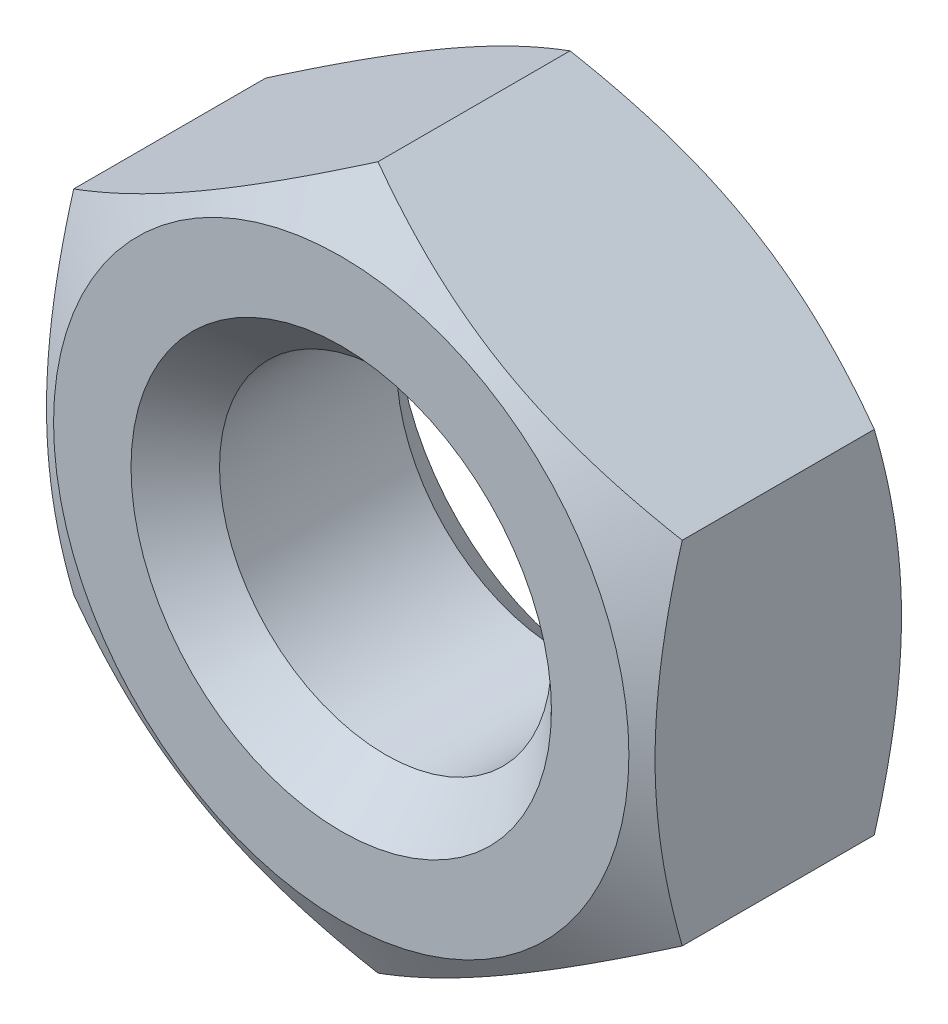
ISO-10303-21;
HEADER;
FILE_DESCRIPTION(('STEP AP214'),'2;1');
FILE_NAME('part.step','',(''),(''),'','','');
FILE_SCHEMA(('AUTOMOTIVE_DESIGN { 1 0 10303 214 1 1 1 1 }'));
ENDSEC;
DATA;
#1=APPLICATION_CONTEXT('core data for automotive mechanical design processes');
#2=APPLICATION_PROTOCOL_DEFINITION('international standard','automotive_design',2000,#1);
#3=PRODUCT_CONTEXT('',#1,'mechanical');
#4=PRODUCT('Part','Part','',(#3));
#5=PRODUCT_RELATED_PRODUCT_CATEGORY('part','',(#4));
#6=PRODUCT_DEFINITION_FORMATION('','',#4);
#7=PRODUCT_DEFINITION_CONTEXT('part definition',#1,'design');
#8=PRODUCT_DEFINITION('design','',#6,#7);
#9=PRODUCT_DEFINITION_SHAPE('','',#8);
#10=(LENGTH_UNIT() NAMED_UNIT(*) SI_UNIT(.MILLI.,.METRE.));
#11=(NAMED_UNIT(*) PLANE_ANGLE_UNIT() SI_UNIT($,.RADIAN.));
#12=(NAMED_UNIT(*) SI_UNIT($,.STERADIAN.) SOLID_ANGLE_UNIT());
#13=UNCERTAINTY_MEASURE_WITH_UNIT(LENGTH_MEASURE(1.E-05),#10,'distance_accuracy_value','');
#14=(GEOMETRIC_REPRESENTATION_CONTEXT(3) GLOBAL_UNCERTAINTY_ASSIGNED_CONTEXT((#13)) GLOBAL_UNIT_ASSIGNED_CONTEXT((#10,
#11,#12)) REPRESENTATION_CONTEXT('',''));
#15=CARTESIAN_POINT('',(0.,0.,0.));
#16=DIRECTION('',(0.,0.,1.));
#17=DIRECTION('',(1.,0.,0.));
#18=AXIS2_PLACEMENT_3D('',#15,#16,#17);
#19=CARTESIAN_POINT('',(0.,0.,0.));
#20=DIRECTION('',(0.,0.,-1.));
#21=DIRECTION('',(-1.,0.,0.));
#22=AXIS2_PLACEMENT_3D('',#19,#20,#21);
#23=PLANE('',#22);
#24=CARTESIAN_POINT('',(0.,0.,0.));
#25=DIRECTION('',(0.,0.,-1.));
#26=DIRECTION('',(-1.,0.,0.));
#27=AXIS2_PLACEMENT_3D('',#24,#25,#26);
#28=CIRCLE('',#27,1.9);
#29=CARTESIAN_POINT('',(-1.9,0.,0.));
#30=VERTEX_POINT('',#29);
#31=EDGE_CURVE('E123',#30,#30,#28,.T.);
#32=ORIENTED_EDGE('',*,*,#31,.T.);
#33=EDGE_LOOP('',(#32));
#34=FACE_BOUND('',#33,.T.);
#35=CARTESIAN_POINT('',(0.,0.,0.));
#36=DIRECTION('',(0.,0.,1.));
#37=DIRECTION('',(1.,0.,0.));
#38=AXIS2_PLACEMENT_3D('',#35,#36,#37);
#39=CIRCLE('',#38,2.6);
#40=CARTESIAN_POINT('',(2.6,0.,0.));
#41=VERTEX_POINT('',#40);
#42=EDGE_CURVE('E244',#41,#41,#39,.T.);
#43=ORIENTED_EDGE('',*,*,#42,.T.);
#44=EDGE_LOOP('',(#43));
#45=FACE_BOUND('',#44,.T.);
#46=ADVANCED_FACE('F36',(#34,#45),#23,.F.);
#47=CARTESIAN_POINT('',(0.,0.,-2.4));
#48=DIRECTION('',(0.,0.,1.));
#49=DIRECTION('',(1.,0.,0.));
#50=AXIS2_PLACEMENT_3D('',#47,#48,#49);
#51=PLANE('',#50);
#52=CARTESIAN_POINT('',(0.,0.,-2.4));
#53=DIRECTION('',(0.,0.,1.));
#54=DIRECTION('',(1.,0.,0.));
#55=AXIS2_PLACEMENT_3D('',#52,#53,#54);
#56=CIRCLE('',#55,1.9);
#57=CARTESIAN_POINT('',(1.9,0.,-2.4));
#58=VERTEX_POINT('',#57);
#59=EDGE_CURVE('E12',#58,#58,#56,.T.);
#60=ORIENTED_EDGE('',*,*,#59,.T.);
#61=EDGE_LOOP('',(#60));
#62=FACE_BOUND('',#61,.T.);
#63=CARTESIAN_POINT('',(0.,0.,-2.4));
#64=DIRECTION('',(0.,0.,1.));
#65=DIRECTION('',(1.,0.,0.));
#66=AXIS2_PLACEMENT_3D('',#63,#64,#65);
#67=CIRCLE('',#66,2.6);
#68=CARTESIAN_POINT('',(2.6,0.,-2.4));
#69=VERTEX_POINT('',#68);
#70=EDGE_CURVE('E243',#69,#69,#67,.T.);
#71=ORIENTED_EDGE('',*,*,#70,.F.);
#72=EDGE_LOOP('',(#71));
#73=FACE_BOUND('',#72,.T.);
#74=ADVANCED_FACE('F209',(#62,#73),#51,.F.);
#75=CARTESIAN_POINT('',(0.,0.,-2.4));
#76=DIRECTION('',(0.,0.,1.));
#77=DIRECTION('',(1.,0.,0.));
#78=AXIS2_PLACEMENT_3D('',#75,#76,#77);
#79=CYLINDRICAL_SURFACE('',#78,1.5);
#80=CARTESIAN_POINT('',(0.,0.,-0.400000000000002));
#81=DIRECTION('',(0.,0.,-1.));
#82=DIRECTION('',(-1.,0.,0.));
#83=AXIS2_PLACEMENT_3D('',#80,#81,#82);
#84=CIRCLE('',#83,1.5);
#85=CARTESIAN_POINT('',(-1.5,0.,-0.400000000000002));
#86=VERTEX_POINT('',#85);
#87=EDGE_CURVE('E44',#86,#86,#84,.F.);
#88=ORIENTED_EDGE('',*,*,#87,.T.);
#89=EDGE_LOOP('',(#88));
#90=FACE_BOUND('',#89,.T.);
#91=CARTESIAN_POINT('',(0.,0.,-2.));
#92=DIRECTION('',(0.,0.,1.));
#93=DIRECTION('',(1.,0.,0.));
#94=AXIS2_PLACEMENT_3D('',#91,#92,#93);
#95=CIRCLE('',#94,1.5);
#96=CARTESIAN_POINT('',(1.5,0.,-2.));
#97=VERTEX_POINT('',#96);
#98=EDGE_CURVE('E235',#97,#97,#95,.F.);
#99=ORIENTED_EDGE('',*,*,#98,.T.);
#100=EDGE_LOOP('',(#99));
#101=FACE_BOUND('',#100,.T.);
#102=ADVANCED_FACE('F206',(#90,#101),#79,.F.);
#103=CARTESIAN_POINT('',(0.,0.,-2.06777736655969));
#104=DIRECTION('',(0.,0.,1.));
#105=DIRECTION('',(1.,0.,0.));
#106=AXIS2_PLACEMENT_3D('',#103,#104,#105);
#107=CONICAL_SURFACE('',#106,3.17542648054294,1.0471975511966);
#108=ORIENTED_EDGE('',*,*,#70,.T.);
#109=EDGE_LOOP('',(#108));
#110=FACE_BOUND('',#109,.T.);
#111=CARTESIAN_POINT('',(-0.000200000000000284,-3.17554195059678,-2.06771069625679));
#112=CARTESIAN_POINT('',(0.120649220659906,-3.10576962051743,-2.10800979737229));
#113=CARTESIAN_POINT('',(0.242541602622634,-3.03539502097908,-2.14466055702389));
#114=CARTESIAN_POINT('',(0.488437126727893,-2.89342717394439,-2.20863527665175));
#115=CARTESIAN_POINT('',(0.612444638573856,-2.82183140359858,-2.23593660394706));
#116=CARTESIAN_POINT('',(0.858922797975945,-2.67952717191842,-2.27843571432744));
#117=CARTESIAN_POINT('',(0.981355518587418,-2.60884060771577,-2.2939163409991));
#118=CARTESIAN_POINT('',(1.22679714236892,-2.46713482015519,-2.31239806225161));
#119=CARTESIAN_POINT('',(1.34980515323291,-2.39611611197038,-2.31541446015895));
#120=CARTESIAN_POINT('',(1.57965878661079,-2.26341005486544,-2.30914431419301));
#121=CARTESIAN_POINT('',(1.68653879125402,-2.20170285541369,-2.30139730534485));
#122=CARTESIAN_POINT('',(1.89960246733475,-2.07869048467395,-2.2768422785572));
#123=CARTESIAN_POINT('',(2.00578540164889,-2.01738573896433,-2.26002586997098));
#124=CARTESIAN_POINT('',(2.21928848939318,-1.89411967378235,-2.2179855372756));
#125=CARTESIAN_POINT('',(2.32658161614286,-1.83217395817123,-2.19258337893432));
#126=CARTESIAN_POINT('',(2.53956747928405,-1.70920651275308,-2.13493023378157));
#127=CARTESIAN_POINT('',(2.64526294502665,-1.64818320715446,-2.10269279632257));
#128=CARTESIAN_POINT('',(2.7502,-1.58759777021763,-2.06771069625679));
#129=B_SPLINE_CURVE_WITH_KNOTS('',3,(#111,#112,#113,#114,#115,#116,#117,#118,#119,#120,#121,
#122,#123,#124,#125,#126,#127,#128),.UNSPECIFIED.,.F.,.F.,(4,2,2,2,2,2,2,2,4),(0.,
0.435912828725889,0.872873557116334,1.29901931904672,1.72464171213574,2.09526089052938,
2.46622354066374,2.84541551798557,3.22386274754524),.UNSPECIFIED.);
#130=CARTESIAN_POINT('',(0.,-3.17542648054294,-2.06777736655969));
#131=VERTEX_POINT('',#130);
#132=CARTESIAN_POINT('',(2.75,-1.58771324027147,-2.06777736655969));
#133=VERTEX_POINT('',#132);
#134=EDGE_CURVE('E247',#131,#133,#129,.T.);
#135=ORIENTED_EDGE('',*,*,#134,.F.);
#136=CARTESIAN_POINT('',(-2.7502,-1.58759777021763,-2.06771069625679));
#137=CARTESIAN_POINT('',(-2.62935077934009,-1.65737010029699,-2.10800979737229));
#138=CARTESIAN_POINT('',(-2.50745839737737,-1.72774469983533,-2.14466055702389));
#139=CARTESIAN_POINT('',(-2.26156287327211,-1.86971254687003,-2.20863527665175));
#140=CARTESIAN_POINT('',(-2.13755536142614,-1.94130831721583,-2.23593660394706));
#141=CARTESIAN_POINT('',(-1.89107720202406,-2.08361254889599,-2.27843571432744));
#142=CARTESIAN_POINT('',(-1.76864448141258,-2.15429911309864,-2.2939163409991));
#143=CARTESIAN_POINT('',(-1.52320285763108,-2.29600490065923,-2.31239806225161));
#144=CARTESIAN_POINT('',(-1.40019484676709,-2.36702360884404,-2.31541446015896));
#145=CARTESIAN_POINT('',(-1.17034121338921,-2.49972966594897,-2.30914431419301));
#146=CARTESIAN_POINT('',(-1.06346120874598,-2.56143686540073,-2.30139730534485));
#147=CARTESIAN_POINT('',(-0.850397532665249,-2.68444923614047,-2.2768422785572));
#148=CARTESIAN_POINT('',(-0.74421459835111,-2.74575398185008,-2.26002586997098));
#149=CARTESIAN_POINT('',(-0.530711510606816,-2.86902004703207,-2.2179855372756));
#150=CARTESIAN_POINT('',(-0.423418383857144,-2.93096576264318,-2.19258337893432));
#151=CARTESIAN_POINT('',(-0.210432520715948,-3.05393320806134,-2.13493023378157));
#152=CARTESIAN_POINT('',(-0.104737054973347,-3.11495651365995,-2.10269279632257));
#153=CARTESIAN_POINT('',(0.000199999999999426,-3.17554195059678,-2.06771069625679));
#154=B_SPLINE_CURVE_WITH_KNOTS('',3,(#136,#137,#138,#139,#140,#141,#142,#143,#144,#145,#146,
#147,#148,#149,#150,#151,#152,#153),.UNSPECIFIED.,.F.,.F.,(4,2,2,2,2,2,2,2,4),(0.,
0.435912828725889,0.872873557116333,1.29901931904672,1.72464171213574,2.09526089052938,
2.46622354066375,2.84541551798557,3.22386274754524),.UNSPECIFIED.);
#155=CARTESIAN_POINT('',(-2.75,-1.58771324027147,-2.06777736655969));
#156=VERTEX_POINT('',#155);
#157=EDGE_CURVE('E192',#156,#131,#154,.T.);
#158=ORIENTED_EDGE('',*,*,#157,.F.);
#159=CARTESIAN_POINT('',(-2.75,-4.19884947767623,-1.00324729523422));
#160=CARTESIAN_POINT('',(-2.75,-4.07820187124267,-1.0615009399061));
#161=CARTESIAN_POINT('',(-2.75,-3.95726765142687,-1.1191718051079));
#162=CARTESIAN_POINT('',(-2.75,-3.71467095127294,-1.23301467455796));
#163=CARTESIAN_POINT('',(-2.75,-3.59300834795839,-1.28918641643437));
#164=CARTESIAN_POINT('',(-2.75,-3.34813668893729,-1.39999627791941));
#165=CARTESIAN_POINT('',(-2.75,-3.22492276000227,-1.45462366765477));
#166=CARTESIAN_POINT('',(-2.75,-2.97747774547981,-1.56151471187697));
#167=CARTESIAN_POINT('',(-2.75,-2.85324671376196,-1.61377849060522));
#168=CARTESIAN_POINT('',(-2.75,-2.60208370369777,-1.71591086029007));
#169=CARTESIAN_POINT('',(-2.75,-2.47513715768685,-1.76574382426539));
#170=CARTESIAN_POINT('',(-2.75,-2.21974245679256,-1.86147679334899));
#171=CARTESIAN_POINT('',(-2.75,-2.09129413609857,-1.90737635942135));
#172=CARTESIAN_POINT('',(-2.75,-1.83295938473879,-1.99400044635392));
#173=CARTESIAN_POINT('',(-2.75,-1.70307671728886,-2.03473607471567));
#174=CARTESIAN_POINT('',(-2.75,-1.44146555885123,-2.10970156439133));
#175=CARTESIAN_POINT('',(-2.75,-1.30973766944262,-2.14393349536887));
#176=CARTESIAN_POINT('',(-2.75,-1.04434124503234,-2.20422326752026));
#177=CARTESIAN_POINT('',(-2.75,-0.910672058310025,-2.23027829396732));
#178=CARTESIAN_POINT('',(-2.75,-0.641735620473645,-2.27244973081023));
#179=CARTESIAN_POINT('',(-2.75,-0.506468365718288,-2.28856611855589));
#180=CARTESIAN_POINT('',(-2.75,-0.23589149454194,-2.3094342529984));
#181=CARTESIAN_POINT('',(-2.75,-0.100587471778889,-2.31425668852583));
#182=CARTESIAN_POINT('',(-2.75,0.169905978990568,-2.31228604098852));
#183=CARTESIAN_POINT('',(-2.75,0.305095427389367,-2.30549591165469));
#184=CARTESIAN_POINT('',(-2.75,0.536330663357067,-2.28442535724379));
#185=CARTESIAN_POINT('',(-2.75,0.632632338062295,-2.27280685654652));
#186=CARTESIAN_POINT('',(-2.75,0.824483683551794,-2.24443929714952));
#187=CARTESIAN_POINT('',(-2.75,0.920033231736865,-2.22768941908104));
#188=CARTESIAN_POINT('',(-2.75,1.20548016226049,-2.17062279013484));
#189=CARTESIAN_POINT('',(-2.75,1.39403020083751,-2.12350401114232));
#190=CARTESIAN_POINT('',(-2.75,1.67614316578904,-2.04233927716781));
#191=CARTESIAN_POINT('',(-2.75,1.77117911516138,-2.0131269363236));
#192=CARTESIAN_POINT('',(-2.75,1.96025880041966,-1.95183724381465));
#193=CARTESIAN_POINT('',(-2.75,2.05430317417982,-1.91976187783346));
#194=CARTESIAN_POINT('',(-2.75,2.2410062869198,-1.85341152507458));
#195=CARTESIAN_POINT('',(-2.75,2.33366985134413,-1.81914998009173));
#196=CARTESIAN_POINT('',(-2.75,2.51828022728366,-1.74863247237806));
#197=CARTESIAN_POINT('',(-2.75,2.61022672765318,-1.71237569347922));
#198=CARTESIAN_POINT('',(-2.75,2.70184189574077,-1.67531873375452));
#199=B_SPLINE_CURVE_WITH_KNOTS('',3,(#159,#160,#161,#162,#163,#164,#165,#166,#167,#168,#169,
#170,#171,#172,#173,#174,#175,#176,#177,#178,#179,#180,#181,#182,#183,#184,#185,#186,#187,#188,
#189,#190,#191,#192,#193,#194,#195,#196,#197,#198),.UNSPECIFIED.,.F.,.F.,(4,2,2,2,2,2,2,2,2,2,2,
2,2,2,2,2,2,2,2,4),(0.,0.401930814051669,0.803931517493362,1.2082537458897,1.61255469663453,
2.02163603949035,2.43076298365977,2.83899440936265,3.24709570567847,3.65533732855418,
4.06357988181069,4.46926033631124,4.87483761871264,5.1656953663785,5.45659958189496,
6.03884523217754,6.33709483857768,6.6351391744495,6.93150072183923,7.22798441293264),.UNSPECIFIED.);
#200=CARTESIAN_POINT('',(-2.75,1.58771324027147,-2.06777736655969));
#201=VERTEX_POINT('',#200);
#202=EDGE_CURVE('E186',#201,#156,#199,.F.);
#203=ORIENTED_EDGE('',*,*,#202,.F.);
#204=CARTESIAN_POINT('',(0.000200000000000284,3.17554195059678,-2.06771069625679));
#205=CARTESIAN_POINT('',(-0.120649220659906,3.10576962051743,-2.10800979737229));
#206=CARTESIAN_POINT('',(-0.242541602622634,3.03539502097908,-2.14466055702389));
#207=CARTESIAN_POINT('',(-0.488437126727893,2.89342717394439,-2.20863527665175));
#208=CARTESIAN_POINT('',(-0.612444638573857,2.82183140359858,-2.23593660394706));
#209=CARTESIAN_POINT('',(-0.858922797975945,2.67952717191842,-2.27843571432744));
#210=CARTESIAN_POINT('',(-0.981355518587419,2.60884060771577,-2.2939163409991));
#211=CARTESIAN_POINT('',(-1.22679714236892,2.46713482015519,-2.31239806225161));
#212=CARTESIAN_POINT('',(-1.34980515323291,2.39611611197038,-2.31541446015895));
#213=CARTESIAN_POINT('',(-1.5796587866108,2.26341005486544,-2.30914431419301));
#214=CARTESIAN_POINT('',(-1.68653879125402,2.20170285541369,-2.30139730534485));
#215=CARTESIAN_POINT('',(-1.89960246733475,2.07869048467395,-2.2768422785572));
#216=CARTESIAN_POINT('',(-2.00578540164889,2.01738573896433,-2.26002586997098));
#217=CARTESIAN_POINT('',(-2.21928848939319,1.89411967378235,-2.2179855372756));
#218=CARTESIAN_POINT('',(-2.32658161614286,1.83217395817123,-2.19258337893432));
#219=CARTESIAN_POINT('',(-2.53956747928405,1.70920651275308,-2.13493023378157));
#220=CARTESIAN_POINT('',(-2.64526294502665,1.64818320715446,-2.10269279632257));
#221=CARTESIAN_POINT('',(-2.7502,1.58759777021763,-2.06771069625679));
#222=B_SPLINE_CURVE_WITH_KNOTS('',3,(#204,#205,#206,#207,#208,#209,#210,#211,#212,#213,#214,
#215,#216,#217,#218,#219,#220,#221),.UNSPECIFIED.,.F.,.F.,(4,2,2,2,2,2,2,2,4),(0.,
0.43591282872589,0.872873557116334,1.29901931904672,1.72464171213574,2.09526089052938,
2.46622354066374,2.84541551798557,3.22386274754524),.UNSPECIFIED.);
#223=CARTESIAN_POINT('',(0.,3.17542648054294,-2.06777736655969));
#224=VERTEX_POINT('',#223);
#225=EDGE_CURVE('E90',#224,#201,#222,.T.);
#226=ORIENTED_EDGE('',*,*,#225,.F.);
#227=CARTESIAN_POINT('',(2.7502,1.58759777021763,-2.06771069625679));
#228=CARTESIAN_POINT('',(2.62935077934009,1.65737010029699,-2.10800979737229));
#229=CARTESIAN_POINT('',(2.50745839737736,1.72774469983533,-2.14466055702389));
#230=CARTESIAN_POINT('',(2.26156287327211,1.86971254687003,-2.20863527665175));
#231=CARTESIAN_POINT('',(2.13755536142614,1.94130831721583,-2.23593660394706));
#232=CARTESIAN_POINT('',(1.89107720202405,2.08361254889599,-2.27843571432744));
#233=CARTESIAN_POINT('',(1.76864448141258,2.15429911309864,-2.2939163409991));
#234=CARTESIAN_POINT('',(1.52320285763108,2.29600490065923,-2.31239806225161));
#235=CARTESIAN_POINT('',(1.40019484676709,2.36702360884404,-2.31541446015895));
#236=CARTESIAN_POINT('',(1.1703412133892,2.49972966594897,-2.30914431419301));
#237=CARTESIAN_POINT('',(1.06346120874598,2.56143686540073,-2.30139730534485));
#238=CARTESIAN_POINT('',(0.850397532665249,2.68444923614047,-2.2768422785572));
#239=CARTESIAN_POINT('',(0.744214598351109,2.74575398185008,-2.26002586997098));
#240=CARTESIAN_POINT('',(0.530711510606815,2.86902004703207,-2.2179855372756));
#241=CARTESIAN_POINT('',(0.423418383857144,2.93096576264319,-2.19258337893432));
#242=CARTESIAN_POINT('',(0.210432520715949,3.05393320806134,-2.13493023378157));
#243=CARTESIAN_POINT('',(0.104737054973347,3.11495651365995,-2.10269279632257));
#244=CARTESIAN_POINT('',(-0.000199999999999719,3.17554195059678,-2.06771069625679));
#245=B_SPLINE_CURVE_WITH_KNOTS('',3,(#227,#228,#229,#230,#231,#232,#233,#234,#235,#236,#237,
#238,#239,#240,#241,#242,#243,#244),.UNSPECIFIED.,.F.,.F.,(4,2,2,2,2,2,2,2,4),(0.,
0.43591282872589,0.872873557116334,1.29901931904672,1.72464171213574,2.09526089052938,
2.46622354066374,2.84541551798557,3.22386274754524),.UNSPECIFIED.);
#246=CARTESIAN_POINT('',(2.75,1.58771324027147,-2.06777736655969));
#247=VERTEX_POINT('',#246);
#248=EDGE_CURVE('E87',#247,#224,#245,.T.);
#249=ORIENTED_EDGE('',*,*,#248,.F.);
#250=CARTESIAN_POINT('',(2.75,-4.19884947767623,-1.00324729523422));
#251=CARTESIAN_POINT('',(2.75,-4.07820187124267,-1.0615009399061));
#252=CARTESIAN_POINT('',(2.75,-3.95726765142687,-1.1191718051079));
#253=CARTESIAN_POINT('',(2.75,-3.71467095127294,-1.23301467455796));
#254=CARTESIAN_POINT('',(2.75,-3.59300834795839,-1.28918641643437));
#255=CARTESIAN_POINT('',(2.75,-3.34813668893729,-1.39999627791941));
#256=CARTESIAN_POINT('',(2.75,-3.22492276000227,-1.45462366765477));
#257=CARTESIAN_POINT('',(2.75,-2.97747774547981,-1.56151471187697));
#258=CARTESIAN_POINT('',(2.75,-2.85324671376196,-1.61377849060522));
#259=CARTESIAN_POINT('',(2.75,-2.60208370369777,-1.71591086029007));
#260=CARTESIAN_POINT('',(2.75,-2.47513715768685,-1.76574382426539));
#261=CARTESIAN_POINT('',(2.75,-2.21974245679256,-1.86147679334899));
#262=CARTESIAN_POINT('',(2.75,-2.09129413609857,-1.90737635942135));
#263=CARTESIAN_POINT('',(2.75,-1.83295938473879,-1.99400044635392));
#264=CARTESIAN_POINT('',(2.75,-1.70307671728886,-2.03473607471568));
#265=CARTESIAN_POINT('',(2.75,-1.44146555885123,-2.10970156439133));
#266=CARTESIAN_POINT('',(2.75,-1.30973766944262,-2.14393349536887));
#267=CARTESIAN_POINT('',(2.75,-1.04434124503234,-2.20422326752026));
#268=CARTESIAN_POINT('',(2.75,-0.910672058310026,-2.23027829396732));
#269=CARTESIAN_POINT('',(2.75,-0.641735620473646,-2.27244973081023));
#270=CARTESIAN_POINT('',(2.75,-0.506468365718288,-2.28856611855589));
#271=CARTESIAN_POINT('',(2.75,-0.235891494541941,-2.3094342529984));
#272=CARTESIAN_POINT('',(2.75,-0.10058747177889,-2.31425668852583));
#273=CARTESIAN_POINT('',(2.75,0.169905978990567,-2.31228604098852));
#274=CARTESIAN_POINT('',(2.75,0.305095427389366,-2.30549591165469));
#275=CARTESIAN_POINT('',(2.75,0.536330663357066,-2.28442535724379));
#276=CARTESIAN_POINT('',(2.75,0.632632338062294,-2.27280685654652));
#277=CARTESIAN_POINT('',(2.75,0.824483683551794,-2.24443929714952));
#278=CARTESIAN_POINT('',(2.75,0.920033231736864,-2.22768941908104));
#279=CARTESIAN_POINT('',(2.75,1.20548016226049,-2.17062279013484));
#280=CARTESIAN_POINT('',(2.75,1.39403020083751,-2.12350401114232));
#281=CARTESIAN_POINT('',(2.75,1.67614316578904,-2.04233927716781));
#282=CARTESIAN_POINT('',(2.75,1.77117911516138,-2.0131269363236));
#283=CARTESIAN_POINT('',(2.75,1.96025880041966,-1.95183724381465));
#284=CARTESIAN_POINT('',(2.75,2.05430317417981,-1.91976187783346));
#285=CARTESIAN_POINT('',(2.75,2.24100628691979,-1.85341152507458));
#286=CARTESIAN_POINT('',(2.75,2.33366985134412,-1.81914998009174));
#287=CARTESIAN_POINT('',(2.75,2.51828022728366,-1.74863247237806));
#288=CARTESIAN_POINT('',(2.75,2.61022672765318,-1.71237569347922));
#289=CARTESIAN_POINT('',(2.75,2.70184189574077,-1.67531873375452));
#290=B_SPLINE_CURVE_WITH_KNOTS('',3,(#250,#251,#252,#253,#254,#255,#256,#257,#258,#259,#260,
#261,#262,#263,#264,#265,#266,#267,#268,#269,#270,#271,#272,#273,#274,#275,#276,#277,#278,#279,
#280,#281,#282,#283,#284,#285,#286,#287,#288,#289),.UNSPECIFIED.,.F.,.F.,(4,2,2,2,2,2,2,2,2,2,2,
2,2,2,2,2,2,2,2,4),(0.,0.40193081405167,0.803931517493364,1.2082537458897,1.61255469663454,
2.02163603949036,2.43076298365977,2.83899440936265,3.24709570567847,3.65533732855418,
4.06357988181069,4.46926033631124,4.87483761871264,5.1656953663785,5.45659958189496,
6.03884523217754,6.33709483857768,6.6351391744495,6.93150072183922,7.22798441293264),.UNSPECIFIED.);
#291=EDGE_CURVE('E59',#133,#247,#290,.T.);
#292=ORIENTED_EDGE('',*,*,#291,.F.);
#293=EDGE_LOOP('',(#135,#158,#203,#226,#249,#292));
#294=FACE_BOUND('',#293,.T.);
#295=ADVANCED_FACE('F88',(#110,#294),#107,.T.);
#296=CARTESIAN_POINT('',(0.,-3.17542648054294,-13.8551298552221));
#297=DIRECTION('',(0.5,-0.866025403784439,0.));
#298=DIRECTION('',(0.866025403784439,0.5,0.));
#299=AXIS2_PLACEMENT_3D('',#296,#297,#298);
#300=PLANE('',#299);
#301=DIRECTION('',(0.,0.,1.));
#302=VECTOR('',#301,1.);
#303=CARTESIAN_POINT('',(2.75,-1.58771324027147,-13.8551298552221));
#304=LINE('',#303,#302);
#305=CARTESIAN_POINT('',(2.75,-1.58771324027147,-0.332222633440309));
#306=VERTEX_POINT('',#305);
#307=EDGE_CURVE('E103',#133,#306,#304,.T.);
#308=ORIENTED_EDGE('',*,*,#307,.T.);
#309=CARTESIAN_POINT('',(2.7502,-1.58759777021763,-0.332289303743207));
#310=CARTESIAN_POINT('',(2.62935077934009,-1.65737010029699,-0.291990202627709));
#311=CARTESIAN_POINT('',(2.50745839737737,-1.72774469983533,-0.255339442976107));
#312=CARTESIAN_POINT('',(2.26156287327211,-1.86971254687003,-0.191364723348246));
#313=CARTESIAN_POINT('',(2.13755536142614,-1.94130831721583,-0.164063396052942));
#314=CARTESIAN_POINT('',(1.89107720202405,-2.08361254889599,-0.121564285672562));
#315=CARTESIAN_POINT('',(1.76864448141258,-2.15429911309864,-0.106083659000902));
#316=CARTESIAN_POINT('',(1.52320285763108,-2.29600490065923,-0.087601937748385));
#317=CARTESIAN_POINT('',(1.40019484676709,-2.36702360884404,-0.0845855398410443));
#318=CARTESIAN_POINT('',(1.1703412133892,-2.49972966594897,-0.0908556858069916));
#319=CARTESIAN_POINT('',(1.06346120874598,-2.56143686540073,-0.0986026946551474));
#320=CARTESIAN_POINT('',(0.850397532665249,-2.68444923614047,-0.1231577214428));
#321=CARTESIAN_POINT('',(0.744214598351109,-2.74575398185008,-0.139974130029015));
#322=CARTESIAN_POINT('',(0.530711510606815,-2.86902004703206,-0.182014462724402));
#323=CARTESIAN_POINT('',(0.423418383857144,-2.93096576264318,-0.207416621065676));
#324=CARTESIAN_POINT('',(0.210432520715948,-3.05393320806134,-0.265069766218428));
#325=CARTESIAN_POINT('',(0.104737054973347,-3.11495651365995,-0.297307203677429));
#326=CARTESIAN_POINT('',(-0.000200000000000119,-3.17554195059678,-0.332289303743207));
#327=B_SPLINE_CURVE_WITH_KNOTS('',3,(#309,#310,#311,#312,#313,#314,#315,#316,#317,#318,#319,
#320,#321,#322,#323,#324,#325,#326),.UNSPECIFIED.,.F.,.F.,(4,2,2,2,2,2,2,2,4),(0.,
0.435912828725889,0.872873557116334,1.29901931904672,1.72464171213574,2.09526089052938,
2.46622354066374,2.84541551798557,3.22386274754524),.UNSPECIFIED.);
#328=CARTESIAN_POINT('',(0.,-3.17542648054294,-0.332222633440308));
#329=VERTEX_POINT('',#328);
#330=EDGE_CURVE('E116',#306,#329,#327,.T.);
#331=ORIENTED_EDGE('',*,*,#330,.T.);
#332=DIRECTION('',(0.,0.,1.));
#333=VECTOR('',#332,1.);
#334=CARTESIAN_POINT('',(0.,-3.17542648054294,-13.8551298552221));
#335=LINE('',#334,#333);
#336=EDGE_CURVE('E124',#131,#329,#335,.T.);
#337=ORIENTED_EDGE('',*,*,#336,.F.);
#338=ORIENTED_EDGE('',*,*,#134,.T.);
#339=EDGE_LOOP('',(#308,#331,#337,#338));
#340=FACE_BOUND('',#339,.T.);
#341=ADVANCED_FACE('F126',(#340),#300,.T.);
#342=CARTESIAN_POINT('',(-2.75,-1.58771324027147,-13.8551298552221));
#343=DIRECTION('',(-0.5,-0.866025403784439,0.));
#344=DIRECTION('',(0.866025403784439,-0.5,0.));
#345=AXIS2_PLACEMENT_3D('',#342,#343,#344);
#346=PLANE('',#345);
#347=ORIENTED_EDGE('',*,*,#336,.T.);
#348=CARTESIAN_POINT('',(0.000199999999999738,-3.17554195059678,-0.332289303743207));
#349=CARTESIAN_POINT('',(-0.120649220659907,-3.10576962051743,-0.291990202627709));
#350=CARTESIAN_POINT('',(-0.242541602622634,-3.03539502097908,-0.255339442976108));
#351=CARTESIAN_POINT('',(-0.488437126727893,-2.89342717394439,-0.191364723348246));
#352=CARTESIAN_POINT('',(-0.612444638573856,-2.82183140359858,-0.164063396052942));
#353=CARTESIAN_POINT('',(-0.858922797975945,-2.67952717191842,-0.121564285672562));
#354=CARTESIAN_POINT('',(-0.981355518587418,-2.60884060771577,-0.106083659000902));
#355=CARTESIAN_POINT('',(-1.22679714236892,-2.46713482015518,-0.087601937748385));
#356=CARTESIAN_POINT('',(-1.34980515323291,-2.39611611197038,-0.0845855398410443));
#357=CARTESIAN_POINT('',(-1.57965878661079,-2.26341005486544,-0.0908556858069914));
#358=CARTESIAN_POINT('',(-1.68653879125402,-2.20170285541369,-0.0986026946551472));
#359=CARTESIAN_POINT('',(-1.89960246733475,-2.07869048467395,-0.1231577214428));
#360=CARTESIAN_POINT('',(-2.00578540164889,-2.01738573896433,-0.139974130029015));
#361=CARTESIAN_POINT('',(-2.21928848939318,-1.89411967378235,-0.182014462724401));
#362=CARTESIAN_POINT('',(-2.32658161614286,-1.83217395817123,-0.207416621065676));
#363=CARTESIAN_POINT('',(-2.53956747928405,-1.70920651275308,-0.265069766218428));
#364=CARTESIAN_POINT('',(-2.64526294502665,-1.64818320715446,-0.297307203677428));
#365=CARTESIAN_POINT('',(-2.7502,-1.58759777021763,-0.332289303743206));
#366=B_SPLINE_CURVE_WITH_KNOTS('',3,(#348,#349,#350,#351,#352,#353,#354,#355,#356,#357,#358,
#359,#360,#361,#362,#363,#364,#365),.UNSPECIFIED.,.F.,.F.,(4,2,2,2,2,2,2,2,4),(0.,
0.435912828725889,0.872873557116333,1.29901931904672,1.72464171213574,2.09526089052938,
2.46622354066374,2.84541551798557,3.22386274754524),.UNSPECIFIED.);
#367=CARTESIAN_POINT('',(-2.75,-1.58771324027147,-0.332222633440309));
#368=VERTEX_POINT('',#367);
#369=EDGE_CURVE('E51',#329,#368,#366,.T.);
#370=ORIENTED_EDGE('',*,*,#369,.T.);
#371=DIRECTION('',(0.,0.,1.));
#372=VECTOR('',#371,1.);
#373=CARTESIAN_POINT('',(-2.75,-1.58771324027147,-13.8551298552221));
#374=LINE('',#373,#372);
#375=EDGE_CURVE('E258',#156,#368,#374,.T.);
#376=ORIENTED_EDGE('',*,*,#375,.F.);
#377=ORIENTED_EDGE('',*,*,#157,.T.);
#378=EDGE_LOOP('',(#347,#370,#376,#377));
#379=FACE_BOUND('',#378,.T.);
#380=ADVANCED_FACE('F200',(#379),#346,.T.);
#381=CARTESIAN_POINT('',(-2.75,1.58771324027147,-13.8551298552221));
#382=DIRECTION('',(-1.,0.,0.));
#383=DIRECTION('',(0.,0.,1.));
#384=AXIS2_PLACEMENT_3D('',#381,#382,#383);
#385=PLANE('',#384);
#386=ORIENTED_EDGE('',*,*,#375,.T.);
#387=CARTESIAN_POINT('',(-2.75,-4.19884947767623,-1.39675270476577));
#388=CARTESIAN_POINT('',(-2.75,-4.07820187124267,-1.3384990600939));
#389=CARTESIAN_POINT('',(-2.75,-3.95726765142687,-1.2808281948921));
#390=CARTESIAN_POINT('',(-2.75,-3.71467095127294,-1.16698532544204));
#391=CARTESIAN_POINT('',(-2.75,-3.59300834795839,-1.11081358356563));
#392=CARTESIAN_POINT('',(-2.75,-3.34813668893729,-1.00000372208059));
#393=CARTESIAN_POINT('',(-2.75,-3.22492276000227,-0.94537633234523));
#394=CARTESIAN_POINT('',(-2.75,-2.97747774547981,-0.838485288123032));
#395=CARTESIAN_POINT('',(-2.75,-2.85324671376196,-0.786221509394774));
#396=CARTESIAN_POINT('',(-2.75,-2.60208370369777,-0.684089139709931));
#397=CARTESIAN_POINT('',(-2.75,-2.47513715768685,-0.634256175734611));
#398=CARTESIAN_POINT('',(-2.75,-2.21974245679256,-0.538523206651007));
#399=CARTESIAN_POINT('',(-2.75,-2.09129413609857,-0.492623640578649));
#400=CARTESIAN_POINT('',(-2.75,-1.83295938473879,-0.405999553646081));
#401=CARTESIAN_POINT('',(-2.75,-1.70307671728886,-0.365263925284324));
#402=CARTESIAN_POINT('',(-2.75,-1.44146555885123,-0.290298435608671));
#403=CARTESIAN_POINT('',(-2.75,-1.30973766944262,-0.256066504631124));
#404=CARTESIAN_POINT('',(-2.75,-1.04434124503234,-0.195776732479738));
#405=CARTESIAN_POINT('',(-2.75,-0.910672058310025,-0.16972170603268));
#406=CARTESIAN_POINT('',(-2.75,-0.641735620473645,-0.127550269189765));
#407=CARTESIAN_POINT('',(-2.75,-0.506468365718288,-0.111433881444105));
#408=CARTESIAN_POINT('',(-2.75,-0.23589149454194,-0.0905657470016007));
#409=CARTESIAN_POINT('',(-2.75,-0.100587471778889,-0.0857433114741653));
#410=CARTESIAN_POINT('',(-2.75,0.169905978990568,-0.0877139590114793));
#411=CARTESIAN_POINT('',(-2.75,0.305095427389366,-0.0945040883453092));
#412=CARTESIAN_POINT('',(-2.75,0.536330663357067,-0.115574642756207));
#413=CARTESIAN_POINT('',(-2.75,0.632632338062295,-0.127193143453475));
#414=CARTESIAN_POINT('',(-2.75,0.824483683551794,-0.155560702850476));
#415=CARTESIAN_POINT('',(-2.75,0.920033231736865,-0.172310580918961));
#416=CARTESIAN_POINT('',(-2.75,1.20548016226049,-0.229377209865157));
#417=CARTESIAN_POINT('',(-2.75,1.39403020083751,-0.276495988857683));
#418=CARTESIAN_POINT('',(-2.75,1.67614316578904,-0.357660722832186));
#419=CARTESIAN_POINT('',(-2.75,1.77117911516139,-0.386873063676402));
#420=CARTESIAN_POINT('',(-2.75,1.96025880041966,-0.448162756185351));
#421=CARTESIAN_POINT('',(-2.75,2.05430317417982,-0.480238122166543));
#422=CARTESIAN_POINT('',(-2.75,2.2410062869198,-0.546588474925424));
#423=CARTESIAN_POINT('',(-2.75,2.33366985134413,-0.580850019908265));
#424=CARTESIAN_POINT('',(-2.75,2.51828022728366,-0.651367527621937));
#425=CARTESIAN_POINT('',(-2.75,2.61022672765319,-0.687624306520783));
#426=CARTESIAN_POINT('',(-2.75,2.70184189574077,-0.724681266245479));
#427=B_SPLINE_CURVE_WITH_KNOTS('',3,(#387,#388,#389,#390,#391,#392,#393,#394,#395,#396,#397,
#398,#399,#400,#401,#402,#403,#404,#405,#406,#407,#408,#409,#410,#411,#412,#413,#414,#415,#416,
#417,#418,#419,#420,#421,#422,#423,#424,#425,#426),.UNSPECIFIED.,.F.,.F.,(4,2,2,2,2,2,2,2,2,2,2,
2,2,2,2,2,2,2,2,4),(0.,0.401930814051669,0.803931517493362,1.2082537458897,1.61255469663453,
2.02163603949035,2.43076298365976,2.83899440936265,3.24709570567847,3.65533732855418,
4.06357988181069,4.46926033631124,4.87483761871264,5.1656953663785,5.45659958189496,
6.03884523217754,6.33709483857768,6.6351391744495,6.93150072183923,7.22798441293264),.UNSPECIFIED.);
#428=CARTESIAN_POINT('',(-2.75,1.58771324027147,-0.332222633440309));
#429=VERTEX_POINT('',#428);
#430=EDGE_CURVE('E149',#368,#429,#427,.T.);
#431=ORIENTED_EDGE('',*,*,#430,.T.);
#432=DIRECTION('',(0.,0.,1.));
#433=VECTOR('',#432,1.);
#434=CARTESIAN_POINT('',(-2.75,1.58771324027147,-13.8551298552221));
#435=LINE('',#434,#433);
#436=EDGE_CURVE('E110',#201,#429,#435,.T.);
#437=ORIENTED_EDGE('',*,*,#436,.F.);
#438=ORIENTED_EDGE('',*,*,#202,.T.);
#439=EDGE_LOOP('',(#386,#431,#437,#438));
#440=FACE_BOUND('',#439,.T.);
#441=ADVANCED_FACE('F197',(#440),#385,.T.);
#442=CARTESIAN_POINT('',(0.,3.17542648054294,-13.8551298552221));
#443=DIRECTION('',(-0.5,0.866025403784439,0.));
#444=DIRECTION('',(-0.866025403784439,-0.5,0.));
#445=AXIS2_PLACEMENT_3D('',#442,#443,#444);
#446=PLANE('',#445);
#447=ORIENTED_EDGE('',*,*,#436,.T.);
#448=CARTESIAN_POINT('',(-2.7502,1.58759777021763,-0.332289303743207));
#449=CARTESIAN_POINT('',(-2.62935077934009,1.65737010029699,-0.291990202627709));
#450=CARTESIAN_POINT('',(-2.50745839737737,1.72774469983533,-0.255339442976108));
#451=CARTESIAN_POINT('',(-2.26156287327211,1.86971254687003,-0.191364723348246));
#452=CARTESIAN_POINT('',(-2.13755536142614,1.94130831721583,-0.164063396052942));
#453=CARTESIAN_POINT('',(-1.89107720202406,2.08361254889599,-0.121564285672562));
#454=CARTESIAN_POINT('',(-1.76864448141258,2.15429911309864,-0.106083659000903));
#455=CARTESIAN_POINT('',(-1.52320285763108,2.29600490065923,-0.0876019377483855));
#456=CARTESIAN_POINT('',(-1.40019484676709,2.36702360884404,-0.0845855398410446));
#457=CARTESIAN_POINT('',(-1.17034121338921,2.49972966594897,-0.0908556858069916));
#458=CARTESIAN_POINT('',(-1.06346120874598,2.56143686540073,-0.0986026946551474));
#459=CARTESIAN_POINT('',(-0.850397532665249,2.68444923614047,-0.1231577214428));
#460=CARTESIAN_POINT('',(-0.744214598351109,2.74575398185008,-0.139974130029016));
#461=CARTESIAN_POINT('',(-0.530711510606815,2.86902004703207,-0.182014462724402));
#462=CARTESIAN_POINT('',(-0.423418383857144,2.93096576264318,-0.207416621065677));
#463=CARTESIAN_POINT('',(-0.210432520715948,3.05393320806134,-0.265069766218428));
#464=CARTESIAN_POINT('',(-0.104737054973347,3.11495651365995,-0.297307203677429));
#465=CARTESIAN_POINT('',(0.000200000000000538,3.17554195059678,-0.332289303743207));
#466=B_SPLINE_CURVE_WITH_KNOTS('',3,(#448,#449,#450,#451,#452,#453,#454,#455,#456,#457,#458,
#459,#460,#461,#462,#463,#464,#465),.UNSPECIFIED.,.F.,.F.,(4,2,2,2,2,2,2,2,4),(0.,
0.435912828725889,0.872873557116333,1.29901931904672,1.72464171213574,2.09526089052938,
2.46622354066375,2.84541551798557,3.22386274754524),.UNSPECIFIED.);
#467=CARTESIAN_POINT('',(0.,3.17542648054294,-0.332222633440309));
#468=VERTEX_POINT('',#467);
#469=EDGE_CURVE('E155',#429,#468,#466,.T.);
#470=ORIENTED_EDGE('',*,*,#469,.T.);
#471=DIRECTION('',(0.,0.,1.));
#472=VECTOR('',#471,1.);
#473=CARTESIAN_POINT('',(0.,3.17542648054294,-13.8551298552221));
#474=LINE('',#473,#472);
#475=EDGE_CURVE('E108',#224,#468,#474,.T.);
#476=ORIENTED_EDGE('',*,*,#475,.F.);
#477=ORIENTED_EDGE('',*,*,#225,.T.);
#478=EDGE_LOOP('',(#447,#470,#476,#477));
#479=FACE_BOUND('',#478,.T.);
#480=ADVANCED_FACE('F171',(#479),#446,.T.);
#481=CARTESIAN_POINT('',(2.75,1.58771324027147,-13.8551298552221));
#482=DIRECTION('',(0.5,0.866025403784438,0.));
#483=DIRECTION('',(-0.866025403784439,0.5,0.));
#484=AXIS2_PLACEMENT_3D('',#481,#482,#483);
#485=PLANE('',#484);
#486=ORIENTED_EDGE('',*,*,#475,.T.);
#487=CARTESIAN_POINT('',(-0.000199999999999795,3.17554195059678,-0.332289303743207));
#488=CARTESIAN_POINT('',(0.120649220659906,3.10576962051743,-0.29199020262771));
#489=CARTESIAN_POINT('',(0.242541602622634,3.03539502097908,-0.255339442976108));
#490=CARTESIAN_POINT('',(0.488437126727893,2.89342717394439,-0.191364723348246));
#491=CARTESIAN_POINT('',(0.612444638573856,2.82183140359858,-0.164063396052943));
#492=CARTESIAN_POINT('',(0.858922797975945,2.67952717191843,-0.121564285672562));
#493=CARTESIAN_POINT('',(0.981355518587419,2.60884060771577,-0.106083659000903));
#494=CARTESIAN_POINT('',(1.22679714236892,2.46713482015519,-0.0876019377483855));
#495=CARTESIAN_POINT('',(1.34980515323291,2.39611611197038,-0.0845855398410446));
#496=CARTESIAN_POINT('',(1.5796587866108,2.26341005486544,-0.0908556858069916));
#497=CARTESIAN_POINT('',(1.68653879125402,2.20170285541369,-0.0986026946551474));
#498=CARTESIAN_POINT('',(1.89960246733475,2.07869048467395,-0.1231577214428));
#499=CARTESIAN_POINT('',(2.00578540164889,2.01738573896434,-0.139974130029016));
#500=CARTESIAN_POINT('',(2.21928848939318,1.89411967378235,-0.182014462724402));
#501=CARTESIAN_POINT('',(2.32658161614285,1.83217395817123,-0.207416621065676));
#502=CARTESIAN_POINT('',(2.53956747928405,1.70920651275308,-0.265069766218427));
#503=CARTESIAN_POINT('',(2.64526294502665,1.64818320715446,-0.297307203677428));
#504=CARTESIAN_POINT('',(2.7502,1.58759777021763,-0.332289303743206));
#505=B_SPLINE_CURVE_WITH_KNOTS('',3,(#487,#488,#489,#490,#491,#492,#493,#494,#495,#496,#497,
#498,#499,#500,#501,#502,#503,#504),.UNSPECIFIED.,.F.,.F.,(4,2,2,2,2,2,2,2,4),(0.,
0.435912828725889,0.872873557116333,1.29901931904672,1.72464171213574,2.09526089052938,
2.46622354066374,2.84541551798557,3.22386274754524),.UNSPECIFIED.);
#506=CARTESIAN_POINT('',(2.75,1.58771324027147,-0.332222633440309));
#507=VERTEX_POINT('',#506);
#508=EDGE_CURVE('E107',#468,#507,#505,.T.);
#509=ORIENTED_EDGE('',*,*,#508,.T.);
#510=DIRECTION('',(0.,0.,1.));
#511=VECTOR('',#510,1.);
#512=CARTESIAN_POINT('',(2.75,1.58771324027147,-13.8551298552221));
#513=LINE('',#512,#511);
#514=EDGE_CURVE('E101',#247,#507,#513,.T.);
#515=ORIENTED_EDGE('',*,*,#514,.F.);
#516=ORIENTED_EDGE('',*,*,#248,.T.);
#517=EDGE_LOOP('',(#486,#509,#515,#516));
#518=FACE_BOUND('',#517,.T.);
#519=ADVANCED_FACE('F106',(#518),#485,.T.);
#520=CARTESIAN_POINT('',(2.75,-1.58771324027147,-13.8551298552221));
#521=DIRECTION('',(1.,0.,0.));
#522=DIRECTION('',(0.,1.,0.));
#523=AXIS2_PLACEMENT_3D('',#520,#521,#522);
#524=PLANE('',#523);
#525=ORIENTED_EDGE('',*,*,#514,.T.);
#526=CARTESIAN_POINT('',(2.75,-4.19884947767623,-1.39675270476577));
#527=CARTESIAN_POINT('',(2.75,-4.07820187124267,-1.3384990600939));
#528=CARTESIAN_POINT('',(2.75,-3.95726765142687,-1.2808281948921));
#529=CARTESIAN_POINT('',(2.75,-3.71467095127294,-1.16698532544204));
#530=CARTESIAN_POINT('',(2.75,-3.59300834795839,-1.11081358356563));
#531=CARTESIAN_POINT('',(2.75,-3.34813668893729,-1.00000372208059));
#532=CARTESIAN_POINT('',(2.75,-3.22492276000227,-0.94537633234523));
#533=CARTESIAN_POINT('',(2.75,-2.97747774547981,-0.838485288123032));
#534=CARTESIAN_POINT('',(2.75,-2.85324671376196,-0.786221509394774));
#535=CARTESIAN_POINT('',(2.75,-2.60208370369777,-0.684089139709931));
#536=CARTESIAN_POINT('',(2.75,-2.47513715768685,-0.634256175734611));
#537=CARTESIAN_POINT('',(2.75,-2.21974245679256,-0.538523206651008));
#538=CARTESIAN_POINT('',(2.75,-2.09129413609857,-0.492623640578649));
#539=CARTESIAN_POINT('',(2.75,-1.83295938473879,-0.405999553646081));
#540=CARTESIAN_POINT('',(2.75,-1.70307671728886,-0.365263925284324));
#541=CARTESIAN_POINT('',(2.75,-1.44146555885123,-0.290298435608671));
#542=CARTESIAN_POINT('',(2.75,-1.30973766944262,-0.256066504631124));
#543=CARTESIAN_POINT('',(2.75,-1.04434124503234,-0.195776732479738));
#544=CARTESIAN_POINT('',(2.75,-0.910672058310026,-0.16972170603268));
#545=CARTESIAN_POINT('',(2.75,-0.641735620473646,-0.127550269189765));
#546=CARTESIAN_POINT('',(2.75,-0.506468365718289,-0.111433881444105));
#547=CARTESIAN_POINT('',(2.75,-0.235891494541941,-0.0905657470016007));
#548=CARTESIAN_POINT('',(2.75,-0.10058747177889,-0.085743311474165));
#549=CARTESIAN_POINT('',(2.75,0.169905978990566,-0.0877139590114788));
#550=CARTESIAN_POINT('',(2.75,0.305095427389365,-0.0945040883453086));
#551=CARTESIAN_POINT('',(2.75,0.536330663357066,-0.115574642756206));
#552=CARTESIAN_POINT('',(2.75,0.632632338062293,-0.127193143453474));
#553=CARTESIAN_POINT('',(2.75,0.824483683551793,-0.155560702850476));
#554=CARTESIAN_POINT('',(2.75,0.920033231736863,-0.172310580918961));
#555=CARTESIAN_POINT('',(2.75,1.20548016226049,-0.229377209865156));
#556=CARTESIAN_POINT('',(2.75,1.39403020083751,-0.276495988857682));
#557=CARTESIAN_POINT('',(2.75,1.67614316578904,-0.357660722832184));
#558=CARTESIAN_POINT('',(2.75,1.77117911516138,-0.386873063676401));
#559=CARTESIAN_POINT('',(2.75,1.96025880041966,-0.44816275618535));
#560=CARTESIAN_POINT('',(2.75,2.05430317417981,-0.480238122166542));
#561=CARTESIAN_POINT('',(2.75,2.24100628691979,-0.546588474925423));
#562=CARTESIAN_POINT('',(2.75,2.33366985134412,-0.580850019908263));
#563=CARTESIAN_POINT('',(2.75,2.51828022728366,-0.651367527621935));
#564=CARTESIAN_POINT('',(2.75,2.61022672765318,-0.687624306520781));
#565=CARTESIAN_POINT('',(2.75,2.70184189574077,-0.724681266245477));
#566=B_SPLINE_CURVE_WITH_KNOTS('',3,(#526,#527,#528,#529,#530,#531,#532,#533,#534,#535,#536,
#537,#538,#539,#540,#541,#542,#543,#544,#545,#546,#547,#548,#549,#550,#551,#552,#553,#554,#555,
#556,#557,#558,#559,#560,#561,#562,#563,#564,#565),.UNSPECIFIED.,.F.,.F.,(4,2,2,2,2,2,2,2,2,2,2,
2,2,2,2,2,2,2,2,4),(0.,0.401930814051669,0.803931517493362,1.2082537458897,1.61255469663453,
2.02163603949035,2.43076298365976,2.83899440936265,3.24709570567847,3.65533732855418,
4.06357988181069,4.46926033631124,4.87483761871264,5.1656953663785,5.45659958189495,
6.03884523217754,6.33709483857768,6.6351391744495,6.93150072183922,7.22798441293264),.UNSPECIFIED.);
#567=EDGE_CURVE('E112',#507,#306,#566,.F.);
#568=ORIENTED_EDGE('',*,*,#567,.T.);
#569=ORIENTED_EDGE('',*,*,#307,.F.);
#570=ORIENTED_EDGE('',*,*,#291,.T.);
#571=EDGE_LOOP('',(#525,#568,#569,#570));
#572=FACE_BOUND('',#571,.T.);
#573=ADVANCED_FACE('F99',(#572),#524,.T.);
#574=CARTESIAN_POINT('',(0.,0.,0.));
#575=DIRECTION('',(0.,0.,-1.));
#576=DIRECTION('',(-1.,0.,0.));
#577=AXIS2_PLACEMENT_3D('',#574,#575,#576);
#578=CONICAL_SURFACE('',#577,2.6,1.0471975511966);
#579=ORIENTED_EDGE('',*,*,#508,.F.);
#580=ORIENTED_EDGE('',*,*,#469,.F.);
#581=ORIENTED_EDGE('',*,*,#430,.F.);
#582=ORIENTED_EDGE('',*,*,#369,.F.);
#583=ORIENTED_EDGE('',*,*,#330,.F.);
#584=ORIENTED_EDGE('',*,*,#567,.F.);
#585=EDGE_LOOP('',(#579,#580,#581,#582,#583,#584));
#586=FACE_BOUND('',#585,.T.);
#587=ORIENTED_EDGE('',*,*,#42,.F.);
#588=EDGE_LOOP('',(#587));
#589=FACE_BOUND('',#588,.T.);
#590=ADVANCED_FACE('F130',(#586,#589),#578,.T.);
#591=CARTESIAN_POINT('',(0.,0.,0.));
#592=DIRECTION('',(0.,0.,1.));
#593=DIRECTION('',(1.,0.,0.));
#594=AXIS2_PLACEMENT_3D('',#591,#592,#593);
#595=CONICAL_SURFACE('',#594,1.9,0.785398163397447);
#596=ORIENTED_EDGE('',*,*,#87,.F.);
#597=EDGE_LOOP('',(#596));
#598=FACE_BOUND('',#597,.T.);
#599=ORIENTED_EDGE('',*,*,#31,.F.);
#600=EDGE_LOOP('',(#599));
#601=FACE_BOUND('',#600,.T.);
#602=ADVANCED_FACE('F134',(#598,#601),#595,.F.);
#603=CARTESIAN_POINT('',(0.,0.,-2.4));
#604=DIRECTION('',(0.,0.,-1.));
#605=DIRECTION('',(-1.,0.,0.));
#606=AXIS2_PLACEMENT_3D('',#603,#604,#605);
#607=CONICAL_SURFACE('',#606,1.9,0.785398163397446);
#608=ORIENTED_EDGE('',*,*,#98,.F.);
#609=EDGE_LOOP('',(#608));
#610=FACE_BOUND('',#609,.T.);
#611=ORIENTED_EDGE('',*,*,#59,.F.);
#612=EDGE_LOOP('',(#611));
#613=FACE_BOUND('',#612,.T.);
#614=ADVANCED_FACE('F38',(#610,#613),#607,.F.);
#615=CLOSED_SHELL('',(#46,#74,#102,#295,#341,#380,#441,#480,#519,#573,#590,#602,#614));
#616=MANIFOLD_SOLID_BREP('B2',#615);
#617=ADVANCED_BREP_SHAPE_REPRESENTATION('',(#18,#616),#14);
#618=SHAPE_DEFINITION_REPRESENTATION(#9,#617);
ENDSEC;
END-ISO-10303-21;
